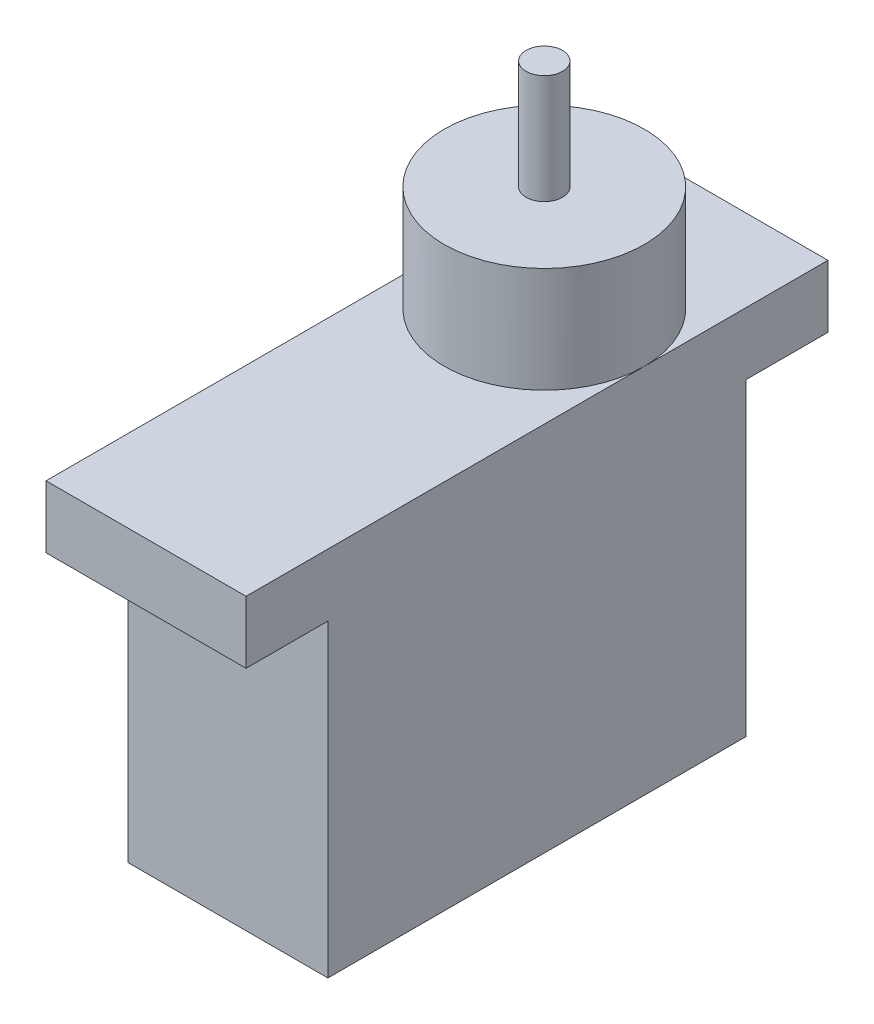
ISO-10303-21;
HEADER;
FILE_DESCRIPTION(('STEP AP214'),'2;1');
FILE_NAME('part.step','',(''),(''),'','','');
FILE_SCHEMA(('AUTOMOTIVE_DESIGN { 1 0 10303 214 1 1 1 1 }'));
ENDSEC;
DATA;
#1=APPLICATION_CONTEXT('core data for automotive mechanical design processes');
#2=APPLICATION_PROTOCOL_DEFINITION('international standard','automotive_design',2000,#1);
#3=PRODUCT_CONTEXT('',#1,'mechanical');
#4=PRODUCT('Part','Part','',(#3));
#5=PRODUCT_RELATED_PRODUCT_CATEGORY('part','',(#4));
#6=PRODUCT_DEFINITION_FORMATION('','',#4);
#7=PRODUCT_DEFINITION_CONTEXT('part definition',#1,'design');
#8=PRODUCT_DEFINITION('design','',#6,#7);
#9=PRODUCT_DEFINITION_SHAPE('','',#8);
#10=(LENGTH_UNIT() NAMED_UNIT(*) SI_UNIT(.MILLI.,.METRE.));
#11=(NAMED_UNIT(*) PLANE_ANGLE_UNIT() SI_UNIT($,.RADIAN.));
#12=(NAMED_UNIT(*) SI_UNIT($,.STERADIAN.) SOLID_ANGLE_UNIT());
#13=UNCERTAINTY_MEASURE_WITH_UNIT(LENGTH_MEASURE(1.E-05),#10,'distance_accuracy_value','');
#14=(GEOMETRIC_REPRESENTATION_CONTEXT(3) GLOBAL_UNCERTAINTY_ASSIGNED_CONTEXT((#13)) GLOBAL_UNIT_ASSIGNED_CONTEXT((#10,
#11,#12)) REPRESENTATION_CONTEXT('',''));
#15=CARTESIAN_POINT('',(0.,0.,0.));
#16=DIRECTION('',(0.,0.,1.));
#17=DIRECTION('',(1.,0.,0.));
#18=AXIS2_PLACEMENT_3D('',#15,#16,#17);
#19=CARTESIAN_POINT('',(5.5,26.23,5.6));
#20=DIRECTION('',(0.,1.,0.));
#21=DIRECTION('',(0.,0.,1.));
#22=AXIS2_PLACEMENT_3D('',#19,#20,#21);
#23=PLANE('',#22);
#24=CARTESIAN_POINT('',(5.5,26.23,5.6));
#25=DIRECTION('',(0.,1.,0.));
#26=DIRECTION('',(0.,0.,1.));
#27=AXIS2_PLACEMENT_3D('',#24,#25,#26);
#28=CIRCLE('',#27,5.5);
#29=CARTESIAN_POINT('',(5.5,26.23,11.1));
#30=VERTEX_POINT('',#29);
#31=EDGE_CURVE('E144',#30,#30,#28,.T.);
#32=ORIENTED_EDGE('',*,*,#31,.T.);
#33=EDGE_LOOP('',(#32));
#34=FACE_BOUND('',#33,.T.);
#35=CARTESIAN_POINT('',(5.5,26.23,5.6));
#36=DIRECTION('',(0.,1.,0.));
#37=DIRECTION('',(0.,0.,1.));
#38=AXIS2_PLACEMENT_3D('',#35,#36,#37);
#39=CIRCLE('',#38,1.);
#40=CARTESIAN_POINT('',(5.5,26.23,6.6));
#41=VERTEX_POINT('',#40);
#42=EDGE_CURVE('E199',#41,#41,#39,.T.);
#43=ORIENTED_EDGE('',*,*,#42,.F.);
#44=EDGE_LOOP('',(#43));
#45=FACE_BOUND('',#44,.T.);
#46=ADVANCED_FACE('F33',(#34,#45),#23,.T.);
#47=CARTESIAN_POINT('',(11.,20.43,27.5));
#48=DIRECTION('',(0.,-1.,0.));
#49=DIRECTION('',(0.,0.,-1.));
#50=AXIS2_PLACEMENT_3D('',#47,#48,#49);
#51=PLANE('',#50);
#52=CARTESIAN_POINT('',(5.5,20.43,5.6));
#53=DIRECTION('',(0.,1.,0.));
#54=DIRECTION('',(0.,0.,1.));
#55=AXIS2_PLACEMENT_3D('',#52,#53,#54);
#56=CIRCLE('',#55,5.5);
#57=CARTESIAN_POINT('',(11.,20.43,5.6));
#58=VERTEX_POINT('',#57);
#59=CARTESIAN_POINT('',(0.,20.43,5.6));
#60=VERTEX_POINT('',#59);
#61=EDGE_CURVE('E43',#58,#60,#56,.T.);
#62=ORIENTED_EDGE('',*,*,#61,.F.);
#63=DIRECTION('',(0.,0.,1.));
#64=VECTOR('',#63,1.);
#65=CARTESIAN_POINT('',(11.,20.43,27.5));
#66=LINE('',#65,#64);
#67=CARTESIAN_POINT('',(11.,20.43,-4.5));
#68=VERTEX_POINT('',#67);
#69=EDGE_CURVE('E188',#68,#58,#66,.T.);
#70=ORIENTED_EDGE('',*,*,#69,.F.);
#71=DIRECTION('',(-1.,0.,0.));
#72=VECTOR('',#71,1.);
#73=CARTESIAN_POINT('',(11.,20.43,-4.5));
#74=LINE('',#73,#72);
#75=CARTESIAN_POINT('',(0.,20.43,-4.5));
#76=VERTEX_POINT('',#75);
#77=EDGE_CURVE('E165',#68,#76,#74,.T.);
#78=ORIENTED_EDGE('',*,*,#77,.T.);
#79=DIRECTION('',(0.,0.,1.));
#80=VECTOR('',#79,1.);
#81=CARTESIAN_POINT('',(0.,20.43,27.5));
#82=LINE('',#81,#80);
#83=EDGE_CURVE('E149',#76,#60,#82,.T.);
#84=ORIENTED_EDGE('',*,*,#83,.T.);
#85=EDGE_LOOP('',(#62,#70,#78,#84));
#86=FACE_BOUND('',#85,.T.);
#87=ADVANCED_FACE('F185',(#86),#51,.F.);
#88=EDGE_CURVE('E11',#60,#58,#56,.T.);
#89=ORIENTED_EDGE('',*,*,#88,.F.);
#90=CARTESIAN_POINT('',(0.,20.43,27.5));
#91=VERTEX_POINT('',#90);
#92=EDGE_CURVE('E148',#60,#91,#82,.T.);
#93=ORIENTED_EDGE('',*,*,#92,.T.);
#94=DIRECTION('',(-1.,0.,0.));
#95=VECTOR('',#94,1.);
#96=CARTESIAN_POINT('',(11.,20.43,27.5));
#97=LINE('',#96,#95);
#98=CARTESIAN_POINT('',(11.,20.43,27.5));
#99=VERTEX_POINT('',#98);
#100=EDGE_CURVE('E162',#99,#91,#97,.T.);
#101=ORIENTED_EDGE('',*,*,#100,.F.);
#102=EDGE_CURVE('E189',#58,#99,#66,.T.);
#103=ORIENTED_EDGE('',*,*,#102,.F.);
#104=EDGE_LOOP('',(#89,#93,#101,#103));
#105=FACE_BOUND('',#104,.T.);
#106=ADVANCED_FACE('F220',(#105),#51,.F.);
#107=CARTESIAN_POINT('',(11.,0.,0.));
#108=DIRECTION('',(0.,0.,1.));
#109=DIRECTION('',(1.,0.,0.));
#110=AXIS2_PLACEMENT_3D('',#107,#108,#109);
#111=PLANE('',#110);
#112=DIRECTION('',(0.,1.,0.));
#113=VECTOR('',#112,1.);
#114=CARTESIAN_POINT('',(0.,0.,0.));
#115=LINE('',#114,#113);
#116=CARTESIAN_POINT('',(0.,0.,0.));
#117=VERTEX_POINT('',#116);
#118=CARTESIAN_POINT('',(0.,17.,0.));
#119=VERTEX_POINT('',#118);
#120=EDGE_CURVE('E140',#117,#119,#115,.T.);
#121=ORIENTED_EDGE('',*,*,#120,.T.);
#122=DIRECTION('',(-1.,0.,0.));
#123=VECTOR('',#122,1.);
#124=CARTESIAN_POINT('',(11.,17.,0.));
#125=LINE('',#124,#123);
#126=CARTESIAN_POINT('',(11.,17.,0.));
#127=VERTEX_POINT('',#126);
#128=EDGE_CURVE('E37',#127,#119,#125,.T.);
#129=ORIENTED_EDGE('',*,*,#128,.F.);
#130=DIRECTION('',(0.,1.,0.));
#131=VECTOR('',#130,1.);
#132=CARTESIAN_POINT('',(11.,0.,0.));
#133=LINE('',#132,#131);
#134=CARTESIAN_POINT('',(11.,0.,0.));
#135=VERTEX_POINT('',#134);
#136=EDGE_CURVE('E158',#135,#127,#133,.T.);
#137=ORIENTED_EDGE('',*,*,#136,.F.);
#138=DIRECTION('',(-1.,0.,0.));
#139=VECTOR('',#138,1.);
#140=CARTESIAN_POINT('',(11.,0.,0.));
#141=LINE('',#140,#139);
#142=EDGE_CURVE('E136',#135,#117,#141,.T.);
#143=ORIENTED_EDGE('',*,*,#142,.T.);
#144=EDGE_LOOP('',(#121,#129,#137,#143));
#145=FACE_BOUND('',#144,.T.);
#146=ADVANCED_FACE('F35',(#145),#111,.F.);
#147=CARTESIAN_POINT('',(11.,17.,0.));
#148=DIRECTION('',(0.,1.,0.));
#149=DIRECTION('',(0.,0.,1.));
#150=AXIS2_PLACEMENT_3D('',#147,#148,#149);
#151=PLANE('',#150);
#152=DIRECTION('',(0.,0.,-1.));
#153=VECTOR('',#152,1.);
#154=CARTESIAN_POINT('',(0.,17.,0.));
#155=LINE('',#154,#153);
#156=CARTESIAN_POINT('',(0.,17.,-4.5));
#157=VERTEX_POINT('',#156);
#158=EDGE_CURVE('E143',#119,#157,#155,.T.);
#159=ORIENTED_EDGE('',*,*,#158,.T.);
#160=DIRECTION('',(-1.,0.,0.));
#161=VECTOR('',#160,1.);
#162=CARTESIAN_POINT('',(11.,17.,-4.5));
#163=LINE('',#162,#161);
#164=CARTESIAN_POINT('',(11.,17.,-4.5));
#165=VERTEX_POINT('',#164);
#166=EDGE_CURVE('E167',#165,#157,#163,.T.);
#167=ORIENTED_EDGE('',*,*,#166,.F.);
#168=DIRECTION('',(0.,0.,-1.));
#169=VECTOR('',#168,1.);
#170=CARTESIAN_POINT('',(11.,17.,0.));
#171=LINE('',#170,#169);
#172=EDGE_CURVE('E98',#127,#165,#171,.T.);
#173=ORIENTED_EDGE('',*,*,#172,.F.);
#174=ORIENTED_EDGE('',*,*,#128,.T.);
#175=EDGE_LOOP('',(#159,#167,#173,#174));
#176=FACE_BOUND('',#175,.T.);
#177=ADVANCED_FACE('F173',(#176),#151,.F.);
#178=CARTESIAN_POINT('',(11.,20.43,-4.5));
#179=DIRECTION('',(0.,0.,1.));
#180=DIRECTION('',(0.,-1.,0.));
#181=AXIS2_PLACEMENT_3D('',#178,#179,#180);
#182=PLANE('',#181);
#183=DIRECTION('',(0.,1.,0.));
#184=VECTOR('',#183,1.);
#185=CARTESIAN_POINT('',(0.,20.43,-4.5));
#186=LINE('',#185,#184);
#187=EDGE_CURVE('E146',#157,#76,#186,.T.);
#188=ORIENTED_EDGE('',*,*,#187,.T.);
#189=ORIENTED_EDGE('',*,*,#77,.F.);
#190=DIRECTION('',(0.,1.,0.));
#191=VECTOR('',#190,1.);
#192=CARTESIAN_POINT('',(11.,20.43,-4.5));
#193=LINE('',#192,#191);
#194=EDGE_CURVE('E191',#165,#68,#193,.T.);
#195=ORIENTED_EDGE('',*,*,#194,.F.);
#196=ORIENTED_EDGE('',*,*,#166,.T.);
#197=EDGE_LOOP('',(#188,#189,#195,#196));
#198=FACE_BOUND('',#197,.T.);
#199=ADVANCED_FACE('F181',(#198),#182,.F.);
#200=CARTESIAN_POINT('',(11.,20.43,27.5));
#201=DIRECTION('',(0.,0.,-1.));
#202=DIRECTION('',(-1.,0.,0.));
#203=AXIS2_PLACEMENT_3D('',#200,#201,#202);
#204=PLANE('',#203);
#205=DIRECTION('',(0.,-1.,0.));
#206=VECTOR('',#205,1.);
#207=CARTESIAN_POINT('',(0.,20.43,27.5));
#208=LINE('',#207,#206);
#209=CARTESIAN_POINT('',(0.,17.,27.5));
#210=VERTEX_POINT('',#209);
#211=EDGE_CURVE('E152',#91,#210,#208,.T.);
#212=ORIENTED_EDGE('',*,*,#211,.T.);
#213=DIRECTION('',(-1.,0.,0.));
#214=VECTOR('',#213,1.);
#215=CARTESIAN_POINT('',(11.,17.,27.5));
#216=LINE('',#215,#214);
#217=CARTESIAN_POINT('',(11.,17.,27.5));
#218=VERTEX_POINT('',#217);
#219=EDGE_CURVE('E131',#218,#210,#216,.T.);
#220=ORIENTED_EDGE('',*,*,#219,.F.);
#221=DIRECTION('',(0.,-1.,0.));
#222=VECTOR('',#221,1.);
#223=CARTESIAN_POINT('',(11.,20.43,27.5));
#224=LINE('',#223,#222);
#225=EDGE_CURVE('E119',#99,#218,#224,.T.);
#226=ORIENTED_EDGE('',*,*,#225,.F.);
#227=ORIENTED_EDGE('',*,*,#100,.T.);
#228=EDGE_LOOP('',(#212,#220,#226,#227));
#229=FACE_BOUND('',#228,.T.);
#230=ADVANCED_FACE('F238',(#229),#204,.F.);
#231=CARTESIAN_POINT('',(11.,17.,27.5));
#232=DIRECTION('',(0.,1.,0.));
#233=DIRECTION('',(0.,0.,1.));
#234=AXIS2_PLACEMENT_3D('',#231,#232,#233);
#235=PLANE('',#234);
#236=DIRECTION('',(0.,0.,-1.));
#237=VECTOR('',#236,1.);
#238=CARTESIAN_POINT('',(0.,17.,27.5));
#239=LINE('',#238,#237);
#240=CARTESIAN_POINT('',(0.,17.,23.));
#241=VERTEX_POINT('',#240);
#242=EDGE_CURVE('E128',#210,#241,#239,.T.);
#243=ORIENTED_EDGE('',*,*,#242,.T.);
#244=DIRECTION('',(-1.,0.,0.));
#245=VECTOR('',#244,1.);
#246=CARTESIAN_POINT('',(11.,17.,23.));
#247=LINE('',#246,#245);
#248=CARTESIAN_POINT('',(11.,17.,23.));
#249=VERTEX_POINT('',#248);
#250=EDGE_CURVE('E125',#249,#241,#247,.T.);
#251=ORIENTED_EDGE('',*,*,#250,.F.);
#252=DIRECTION('',(0.,0.,-1.));
#253=VECTOR('',#252,1.);
#254=CARTESIAN_POINT('',(11.,17.,27.5));
#255=LINE('',#254,#253);
#256=EDGE_CURVE('E112',#218,#249,#255,.T.);
#257=ORIENTED_EDGE('',*,*,#256,.F.);
#258=ORIENTED_EDGE('',*,*,#219,.T.);
#259=EDGE_LOOP('',(#243,#251,#257,#258));
#260=FACE_BOUND('',#259,.T.);
#261=ADVANCED_FACE('F126',(#260),#235,.F.);
#262=CARTESIAN_POINT('',(11.,0.,23.));
#263=DIRECTION('',(0.,0.,-1.));
#264=DIRECTION('',(-1.,0.,0.));
#265=AXIS2_PLACEMENT_3D('',#262,#263,#264);
#266=PLANE('',#265);
#267=DIRECTION('',(0.,-1.,0.));
#268=VECTOR('',#267,1.);
#269=CARTESIAN_POINT('',(0.,0.,23.));
#270=LINE('',#269,#268);
#271=CARTESIAN_POINT('',(0.,0.,23.));
#272=VERTEX_POINT('',#271);
#273=EDGE_CURVE('E155',#241,#272,#270,.T.);
#274=ORIENTED_EDGE('',*,*,#273,.T.);
#275=DIRECTION('',(-1.,0.,0.));
#276=VECTOR('',#275,1.);
#277=CARTESIAN_POINT('',(11.,0.,23.));
#278=LINE('',#277,#276);
#279=CARTESIAN_POINT('',(11.,0.,23.));
#280=VERTEX_POINT('',#279);
#281=EDGE_CURVE('E132',#280,#272,#278,.T.);
#282=ORIENTED_EDGE('',*,*,#281,.F.);
#283=DIRECTION('',(0.,-1.,0.));
#284=VECTOR('',#283,1.);
#285=CARTESIAN_POINT('',(11.,0.,23.));
#286=LINE('',#285,#284);
#287=EDGE_CURVE('E116',#249,#280,#286,.T.);
#288=ORIENTED_EDGE('',*,*,#287,.F.);
#289=ORIENTED_EDGE('',*,*,#250,.T.);
#290=EDGE_LOOP('',(#274,#282,#288,#289));
#291=FACE_BOUND('',#290,.T.);
#292=ADVANCED_FACE('F134',(#291),#266,.F.);
#293=CARTESIAN_POINT('',(11.,0.,0.));
#294=DIRECTION('',(0.,1.,0.));
#295=DIRECTION('',(0.,0.,1.));
#296=AXIS2_PLACEMENT_3D('',#293,#294,#295);
#297=PLANE('',#296);
#298=DIRECTION('',(0.,0.,-1.));
#299=VECTOR('',#298,1.);
#300=CARTESIAN_POINT('',(0.,0.,0.));
#301=LINE('',#300,#299);
#302=EDGE_CURVE('E89',#272,#117,#301,.T.);
#303=ORIENTED_EDGE('',*,*,#302,.T.);
#304=ORIENTED_EDGE('',*,*,#142,.F.);
#305=DIRECTION('',(0.,0.,-1.));
#306=VECTOR('',#305,1.);
#307=CARTESIAN_POINT('',(11.,0.,0.));
#308=LINE('',#307,#306);
#309=EDGE_CURVE('E57',#280,#135,#308,.T.);
#310=ORIENTED_EDGE('',*,*,#309,.F.);
#311=ORIENTED_EDGE('',*,*,#281,.T.);
#312=EDGE_LOOP('',(#303,#304,#310,#311));
#313=FACE_BOUND('',#312,.T.);
#314=ADVANCED_FACE('F229',(#313),#297,.F.);
#315=CARTESIAN_POINT('',(11.,0.,0.));
#316=DIRECTION('',(-1.,0.,0.));
#317=DIRECTION('',(0.,0.,1.));
#318=AXIS2_PLACEMENT_3D('',#315,#316,#317);
#319=PLANE('',#318);
#320=ORIENTED_EDGE('',*,*,#136,.T.);
#321=ORIENTED_EDGE('',*,*,#172,.T.);
#322=ORIENTED_EDGE('',*,*,#194,.T.);
#323=ORIENTED_EDGE('',*,*,#69,.T.);
#324=ORIENTED_EDGE('',*,*,#102,.T.);
#325=ORIENTED_EDGE('',*,*,#225,.T.);
#326=ORIENTED_EDGE('',*,*,#256,.T.);
#327=ORIENTED_EDGE('',*,*,#287,.T.);
#328=ORIENTED_EDGE('',*,*,#309,.T.);
#329=EDGE_LOOP('',(#320,#321,#322,#323,#324,#325,#326,#327,#328));
#330=FACE_BOUND('',#329,.T.);
#331=ADVANCED_FACE('F114',(#330),#319,.F.);
#332=CARTESIAN_POINT('',(0.,0.,0.));
#333=DIRECTION('',(-1.,0.,0.));
#334=DIRECTION('',(0.,0.,1.));
#335=AXIS2_PLACEMENT_3D('',#332,#333,#334);
#336=PLANE('',#335);
#337=ORIENTED_EDGE('',*,*,#120,.F.);
#338=ORIENTED_EDGE('',*,*,#302,.F.);
#339=ORIENTED_EDGE('',*,*,#273,.F.);
#340=ORIENTED_EDGE('',*,*,#242,.F.);
#341=ORIENTED_EDGE('',*,*,#211,.F.);
#342=ORIENTED_EDGE('',*,*,#92,.F.);
#343=ORIENTED_EDGE('',*,*,#83,.F.);
#344=ORIENTED_EDGE('',*,*,#187,.F.);
#345=ORIENTED_EDGE('',*,*,#158,.F.);
#346=EDGE_LOOP('',(#337,#338,#339,#340,#341,#342,#343,#344,#345));
#347=FACE_BOUND('',#346,.T.);
#348=ADVANCED_FACE('F178',(#347),#336,.T.);
#349=CARTESIAN_POINT('',(5.5,26.23,5.6));
#350=DIRECTION('',(0.,-1.,0.));
#351=DIRECTION('',(0.,0.,-1.));
#352=AXIS2_PLACEMENT_3D('',#349,#350,#351);
#353=CYLINDRICAL_SURFACE('',#352,5.5);
#354=ORIENTED_EDGE('',*,*,#31,.F.);
#355=EDGE_LOOP('',(#354));
#356=FACE_BOUND('',#355,.T.);
#357=ORIENTED_EDGE('',*,*,#61,.T.);
#358=ORIENTED_EDGE('',*,*,#88,.T.);
#359=EDGE_LOOP('',(#357,#358));
#360=FACE_BOUND('',#359,.T.);
#361=ADVANCED_FACE('F210',(#356,#360),#353,.T.);
#362=CARTESIAN_POINT('',(5.5,32.23,5.6));
#363=DIRECTION('',(0.,-1.,0.));
#364=DIRECTION('',(0.,0.,-1.));
#365=AXIS2_PLACEMENT_3D('',#362,#363,#364);
#366=CYLINDRICAL_SURFACE('',#365,1.);
#367=CARTESIAN_POINT('',(5.5,32.23,5.6));
#368=DIRECTION('',(0.,1.,0.));
#369=DIRECTION('',(0.,0.,1.));
#370=AXIS2_PLACEMENT_3D('',#367,#368,#369);
#371=CIRCLE('',#370,1.);
#372=CARTESIAN_POINT('',(5.5,32.23,6.6));
#373=VERTEX_POINT('',#372);
#374=EDGE_CURVE('E196',#373,#373,#371,.T.);
#375=ORIENTED_EDGE('',*,*,#374,.F.);
#376=EDGE_LOOP('',(#375));
#377=FACE_BOUND('',#376,.T.);
#378=ORIENTED_EDGE('',*,*,#42,.T.);
#379=EDGE_LOOP('',(#378));
#380=FACE_BOUND('',#379,.T.);
#381=ADVANCED_FACE('F207',(#377,#380),#366,.T.);
#382=CARTESIAN_POINT('',(5.5,32.23,5.6));
#383=DIRECTION('',(0.,1.,0.));
#384=DIRECTION('',(0.,0.,1.));
#385=AXIS2_PLACEMENT_3D('',#382,#383,#384);
#386=PLANE('',#385);
#387=ORIENTED_EDGE('',*,*,#374,.T.);
#388=EDGE_LOOP('',(#387));
#389=FACE_BOUND('',#388,.T.);
#390=ADVANCED_FACE('F205',(#389),#386,.T.);
#391=CLOSED_SHELL('',(#46,#87,#106,#146,#177,#199,#230,#261,#292,#314,#331,#348,#361,#381,#390));
#392=MANIFOLD_SOLID_BREP('B2',#391);
#393=ADVANCED_BREP_SHAPE_REPRESENTATION('',(#18,#392),#14);
#394=SHAPE_DEFINITION_REPRESENTATION(#9,#393);
ENDSEC;
END-ISO-10303-21;
